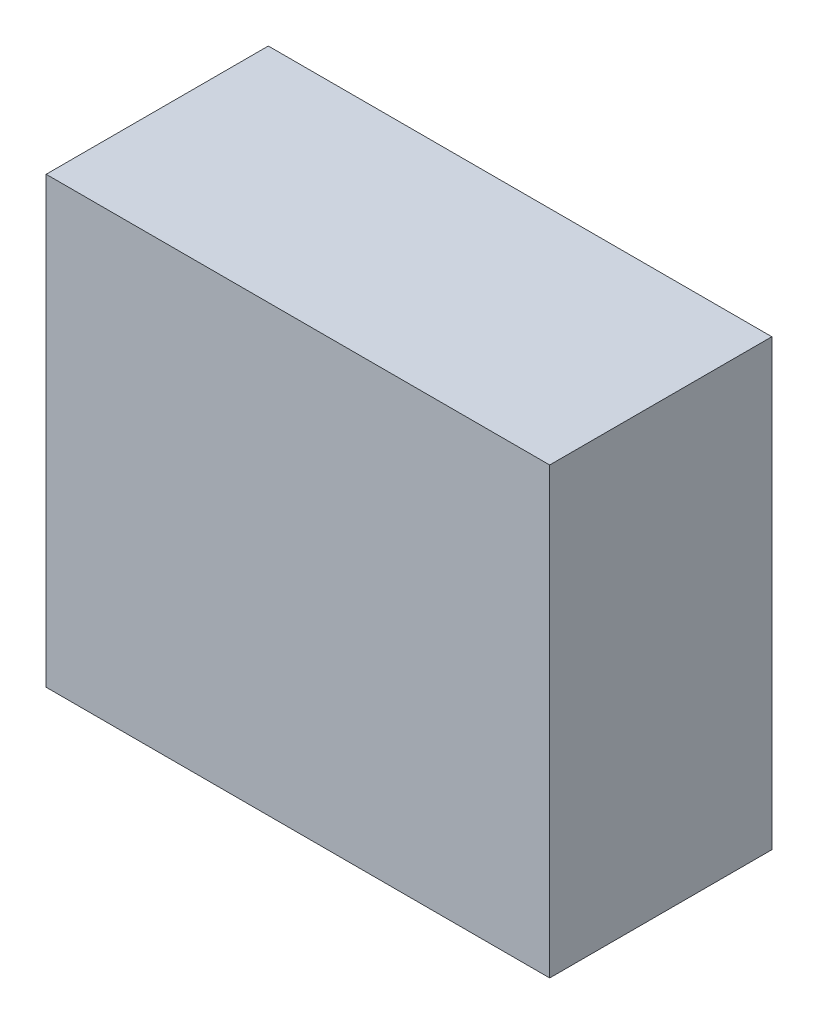
ISO-10303-21;
HEADER;
FILE_DESCRIPTION(('STEP AP214'),'2;1');
FILE_NAME('part.step','',(''),(''),'','','');
FILE_SCHEMA(('AUTOMOTIVE_DESIGN { 1 0 10303 214 1 1 1 1 }'));
ENDSEC;
DATA;
#1=APPLICATION_CONTEXT('core data for automotive mechanical design processes');
#2=APPLICATION_PROTOCOL_DEFINITION('international standard','automotive_design',2000,#1);
#3=PRODUCT_CONTEXT('',#1,'mechanical');
#4=PRODUCT('Part','Part','',(#3));
#5=PRODUCT_RELATED_PRODUCT_CATEGORY('part','',(#4));
#6=PRODUCT_DEFINITION_FORMATION('','',#4);
#7=PRODUCT_DEFINITION_CONTEXT('part definition',#1,'design');
#8=PRODUCT_DEFINITION('design','',#6,#7);
#9=PRODUCT_DEFINITION_SHAPE('','',#8);
#10=(LENGTH_UNIT() NAMED_UNIT(*) SI_UNIT(.MILLI.,.METRE.));
#11=(NAMED_UNIT(*) PLANE_ANGLE_UNIT() SI_UNIT($,.RADIAN.));
#12=(NAMED_UNIT(*) SI_UNIT($,.STERADIAN.) SOLID_ANGLE_UNIT());
#13=UNCERTAINTY_MEASURE_WITH_UNIT(LENGTH_MEASURE(1.E-05),#10,'distance_accuracy_value','');
#14=(GEOMETRIC_REPRESENTATION_CONTEXT(3) GLOBAL_UNCERTAINTY_ASSIGNED_CONTEXT((#13)) GLOBAL_UNIT_ASSIGNED_CONTEXT((#10,
#11,#12)) REPRESENTATION_CONTEXT('',''));
#15=CARTESIAN_POINT('',(0.,0.,0.));
#16=DIRECTION('',(0.,0.,1.));
#17=DIRECTION('',(1.,0.,0.));
#18=AXIS2_PLACEMENT_3D('',#15,#16,#17);
#19=CARTESIAN_POINT('',(-17.,-15.,15.));
#20=DIRECTION('',(1.,0.,0.));
#21=DIRECTION('',(0.,0.,-1.));
#22=AXIS2_PLACEMENT_3D('',#19,#20,#21);
#23=PLANE('',#22);
#24=DIRECTION('',(0.,-1.,0.));
#25=VECTOR('',#24,1.);
#26=CARTESIAN_POINT('',(-17.,-15.,0.));
#27=LINE('',#26,#25);
#28=CARTESIAN_POINT('',(-17.,15.,0.));
#29=VERTEX_POINT('',#28);
#30=CARTESIAN_POINT('',(-17.,-15.,0.));
#31=VERTEX_POINT('',#30);
#32=EDGE_CURVE('E110',#29,#31,#27,.T.);
#33=ORIENTED_EDGE('',*,*,#32,.T.);
#34=DIRECTION('',(0.,0.,-1.));
#35=VECTOR('',#34,1.);
#36=CARTESIAN_POINT('',(-17.,-15.,15.));
#37=LINE('',#36,#35);
#38=CARTESIAN_POINT('',(-17.,-15.,15.));
#39=VERTEX_POINT('',#38);
#40=EDGE_CURVE('E99',#39,#31,#37,.T.);
#41=ORIENTED_EDGE('',*,*,#40,.F.);
#42=DIRECTION('',(0.,-1.,0.));
#43=VECTOR('',#42,1.);
#44=CARTESIAN_POINT('',(-17.,-15.,15.));
#45=LINE('',#44,#43);
#46=CARTESIAN_POINT('',(-17.,15.,15.));
#47=VERTEX_POINT('',#46);
#48=EDGE_CURVE('E93',#47,#39,#45,.T.);
#49=ORIENTED_EDGE('',*,*,#48,.F.);
#50=DIRECTION('',(0.,0.,-1.));
#51=VECTOR('',#50,1.);
#52=CARTESIAN_POINT('',(-17.,15.,15.));
#53=LINE('',#52,#51);
#54=EDGE_CURVE('E106',#47,#29,#53,.T.);
#55=ORIENTED_EDGE('',*,*,#54,.T.);
#56=EDGE_LOOP('',(#33,#41,#49,#55));
#57=FACE_BOUND('',#56,.T.);
#58=ADVANCED_FACE('F38',(#57),#23,.F.);
#59=CARTESIAN_POINT('',(-17.,-15.,15.));
#60=DIRECTION('',(0.,1.,0.));
#61=DIRECTION('',(0.,0.,1.));
#62=AXIS2_PLACEMENT_3D('',#59,#60,#61);
#63=PLANE('',#62);
#64=DIRECTION('',(1.,0.,0.));
#65=VECTOR('',#64,1.);
#66=CARTESIAN_POINT('',(-17.,-15.,0.));
#67=LINE('',#66,#65);
#68=CARTESIAN_POINT('',(17.,-15.,0.));
#69=VERTEX_POINT('',#68);
#70=EDGE_CURVE('E98',#31,#69,#67,.T.);
#71=ORIENTED_EDGE('',*,*,#70,.T.);
#72=DIRECTION('',(0.,0.,-1.));
#73=VECTOR('',#72,1.);
#74=CARTESIAN_POINT('',(17.,-15.,15.));
#75=LINE('',#74,#73);
#76=CARTESIAN_POINT('',(17.,-15.,15.));
#77=VERTEX_POINT('',#76);
#78=EDGE_CURVE('E96',#77,#69,#75,.T.);
#79=ORIENTED_EDGE('',*,*,#78,.F.);
#80=DIRECTION('',(1.,0.,0.));
#81=VECTOR('',#80,1.);
#82=CARTESIAN_POINT('',(-17.,-15.,15.));
#83=LINE('',#82,#81);
#84=EDGE_CURVE('E88',#39,#77,#83,.T.);
#85=ORIENTED_EDGE('',*,*,#84,.F.);
#86=ORIENTED_EDGE('',*,*,#40,.T.);
#87=EDGE_LOOP('',(#71,#79,#85,#86));
#88=FACE_BOUND('',#87,.T.);
#89=ADVANCED_FACE('F97',(#88),#63,.F.);
#90=CARTESIAN_POINT('',(17.,-15.,15.));
#91=DIRECTION('',(-1.,0.,0.));
#92=DIRECTION('',(0.,0.,1.));
#93=AXIS2_PLACEMENT_3D('',#90,#91,#92);
#94=PLANE('',#93);
#95=DIRECTION('',(0.,1.,0.));
#96=VECTOR('',#95,1.);
#97=CARTESIAN_POINT('',(17.,-15.,0.));
#98=LINE('',#97,#96);
#99=CARTESIAN_POINT('',(17.,15.,0.));
#100=VERTEX_POINT('',#99);
#101=EDGE_CURVE('E74',#69,#100,#98,.T.);
#102=ORIENTED_EDGE('',*,*,#101,.T.);
#103=DIRECTION('',(0.,0.,-1.));
#104=VECTOR('',#103,1.);
#105=CARTESIAN_POINT('',(17.,15.,15.));
#106=LINE('',#105,#104);
#107=CARTESIAN_POINT('',(17.,15.,15.));
#108=VERTEX_POINT('',#107);
#109=EDGE_CURVE('E100',#108,#100,#106,.T.);
#110=ORIENTED_EDGE('',*,*,#109,.F.);
#111=DIRECTION('',(0.,1.,0.));
#112=VECTOR('',#111,1.);
#113=CARTESIAN_POINT('',(17.,-15.,15.));
#114=LINE('',#113,#112);
#115=EDGE_CURVE('E91',#77,#108,#114,.T.);
#116=ORIENTED_EDGE('',*,*,#115,.F.);
#117=ORIENTED_EDGE('',*,*,#78,.T.);
#118=EDGE_LOOP('',(#102,#110,#116,#117));
#119=FACE_BOUND('',#118,.T.);
#120=ADVANCED_FACE('F102',(#119),#94,.F.);
#121=CARTESIAN_POINT('',(-17.,15.,15.));
#122=DIRECTION('',(0.,-1.,0.));
#123=DIRECTION('',(0.,0.,-1.));
#124=AXIS2_PLACEMENT_3D('',#121,#122,#123);
#125=PLANE('',#124);
#126=DIRECTION('',(-1.,0.,0.));
#127=VECTOR('',#126,1.);
#128=CARTESIAN_POINT('',(-17.,15.,0.));
#129=LINE('',#128,#127);
#130=EDGE_CURVE('E80',#100,#29,#129,.T.);
#131=ORIENTED_EDGE('',*,*,#130,.T.);
#132=ORIENTED_EDGE('',*,*,#54,.F.);
#133=DIRECTION('',(-1.,0.,0.));
#134=VECTOR('',#133,1.);
#135=CARTESIAN_POINT('',(-17.,15.,15.));
#136=LINE('',#135,#134);
#137=EDGE_CURVE('E57',#108,#47,#136,.T.);
#138=ORIENTED_EDGE('',*,*,#137,.F.);
#139=ORIENTED_EDGE('',*,*,#109,.T.);
#140=EDGE_LOOP('',(#131,#132,#138,#139));
#141=FACE_BOUND('',#140,.T.);
#142=ADVANCED_FACE('F237',(#141),#125,.F.);
#143=CARTESIAN_POINT('',(0.,0.,15.));
#144=DIRECTION('',(0.,0.,-1.));
#145=DIRECTION('',(-1.,0.,0.));
#146=AXIS2_PLACEMENT_3D('',#143,#144,#145);
#147=PLANE('',#146);
#148=ORIENTED_EDGE('',*,*,#48,.T.);
#149=ORIENTED_EDGE('',*,*,#84,.T.);
#150=ORIENTED_EDGE('',*,*,#115,.T.);
#151=ORIENTED_EDGE('',*,*,#137,.T.);
#152=EDGE_LOOP('',(#148,#149,#150,#151));
#153=FACE_BOUND('',#152,.T.);
#154=ADVANCED_FACE('F89',(#153),#147,.F.);
#155=CARTESIAN_POINT('',(0.,0.,0.));
#156=DIRECTION('',(0.,0.,-1.));
#157=DIRECTION('',(-1.,0.,0.));
#158=AXIS2_PLACEMENT_3D('',#155,#156,#157);
#159=PLANE('',#158);
#160=CARTESIAN_POINT('',(11.9999999999999,-8.99999999999998,0.));
#161=DIRECTION('',(0.,0.,-1.));
#162=DIRECTION('',(-1.,0.,0.));
#163=AXIS2_PLACEMENT_3D('',#160,#161,#162);
#164=CIRCLE('',#163,3.10000000000002);
#165=CARTESIAN_POINT('',(8.89999999999993,-8.99999999999998,0.));
#166=VERTEX_POINT('',#165);
#167=EDGE_CURVE('E134',#166,#166,#164,.F.);
#168=ORIENTED_EDGE('',*,*,#167,.T.);
#169=EDGE_LOOP('',(#168));
#170=FACE_BOUND('',#169,.T.);
#171=CARTESIAN_POINT('',(-12.0000000000001,-8.99999999999999,0.));
#172=DIRECTION('',(0.,0.,-1.));
#173=DIRECTION('',(-1.,0.,0.));
#174=AXIS2_PLACEMENT_3D('',#171,#172,#173);
#175=CIRCLE('',#174,3.1);
#176=CARTESIAN_POINT('',(-15.1000000000001,-8.99999999999999,0.));
#177=VERTEX_POINT('',#176);
#178=EDGE_CURVE('E131',#177,#177,#175,.F.);
#179=ORIENTED_EDGE('',*,*,#178,.T.);
#180=EDGE_LOOP('',(#179));
#181=FACE_BOUND('',#180,.T.);
#182=CARTESIAN_POINT('',(-12.0000000000001,9.00000000000001,0.));
#183=DIRECTION('',(0.,0.,-1.));
#184=DIRECTION('',(-1.,0.,0.));
#185=AXIS2_PLACEMENT_3D('',#182,#183,#184);
#186=CIRCLE('',#185,3.1);
#187=CARTESIAN_POINT('',(-15.1000000000001,9.00000000000001,0.));
#188=VERTEX_POINT('',#187);
#189=EDGE_CURVE('E128',#188,#188,#186,.F.);
#190=ORIENTED_EDGE('',*,*,#189,.T.);
#191=EDGE_LOOP('',(#190));
#192=FACE_BOUND('',#191,.T.);
#193=CARTESIAN_POINT('',(11.9999999999999,8.99999999999999,0.));
#194=DIRECTION('',(0.,0.,-1.));
#195=DIRECTION('',(-1.,0.,0.));
#196=AXIS2_PLACEMENT_3D('',#193,#194,#195);
#197=CIRCLE('',#196,3.10000000000002);
#198=CARTESIAN_POINT('',(8.89999999999991,8.99999999999999,0.));
#199=VERTEX_POINT('',#198);
#200=EDGE_CURVE('E124',#199,#199,#197,.F.);
#201=ORIENTED_EDGE('',*,*,#200,.T.);
#202=EDGE_LOOP('',(#201));
#203=FACE_BOUND('',#202,.T.);
#204=ORIENTED_EDGE('',*,*,#32,.F.);
#205=ORIENTED_EDGE('',*,*,#130,.F.);
#206=ORIENTED_EDGE('',*,*,#101,.F.);
#207=ORIENTED_EDGE('',*,*,#70,.F.);
#208=EDGE_LOOP('',(#204,#205,#206,#207));
#209=FACE_BOUND('',#208,.T.);
#210=ADVANCED_FACE('F233',(#170,#181,#192,#203,#209),#159,.T.);
#211=CARTESIAN_POINT('',(-12.0000000000001,-8.99999999999999,6.));
#212=DIRECTION('',(0.,0.,-1.));
#213=DIRECTION('',(-1.,0.,0.));
#214=AXIS2_PLACEMENT_3D('',#211,#212,#213);
#215=CYLINDRICAL_SURFACE('',#214,2.1);
#216=CARTESIAN_POINT('',(-12.0000000000001,-8.99999999999999,1.));
#217=DIRECTION('',(0.,0.,-1.));
#218=DIRECTION('',(-1.,0.,0.));
#219=AXIS2_PLACEMENT_3D('',#216,#217,#218);
#220=CIRCLE('',#219,2.1);
#221=CARTESIAN_POINT('',(-14.1000000000001,-8.99999999999999,1.));
#222=VERTEX_POINT('',#221);
#223=EDGE_CURVE('E138',#222,#222,#220,.T.);
#224=ORIENTED_EDGE('',*,*,#223,.T.);
#225=EDGE_LOOP('',(#224));
#226=FACE_BOUND('',#225,.T.);
#227=CARTESIAN_POINT('',(-12.0000000000001,-8.99999999999999,6.));
#228=DIRECTION('',(0.,0.,-1.));
#229=DIRECTION('',(-1.,0.,0.));
#230=AXIS2_PLACEMENT_3D('',#227,#228,#229);
#231=CIRCLE('',#230,2.1);
#232=CARTESIAN_POINT('',(-14.1000000000001,-8.99999999999999,6.));
#233=VERTEX_POINT('',#232);
#234=EDGE_CURVE('E113',#233,#233,#231,.T.);
#235=ORIENTED_EDGE('',*,*,#234,.F.);
#236=EDGE_LOOP('',(#235));
#237=FACE_BOUND('',#236,.T.);
#238=ADVANCED_FACE('F222',(#226,#237),#215,.F.);
#239=CARTESIAN_POINT('',(-12.0000000000001,-8.99999999999999,6.));
#240=DIRECTION('',(0.,0.,-1.));
#241=DIRECTION('',(-1.,0.,0.));
#242=AXIS2_PLACEMENT_3D('',#239,#240,#241);
#243=PLANE('',#242);
#244=ORIENTED_EDGE('',*,*,#234,.T.);
#245=EDGE_LOOP('',(#244));
#246=FACE_BOUND('',#245,.T.);
#247=ADVANCED_FACE('F214',(#246),#243,.T.);
#248=CARTESIAN_POINT('',(-12.0000000000001,9.00000000000001,6.));
#249=DIRECTION('',(0.,0.,-1.));
#250=DIRECTION('',(-1.,0.,0.));
#251=AXIS2_PLACEMENT_3D('',#248,#249,#250);
#252=CYLINDRICAL_SURFACE('',#251,2.1);
#253=CARTESIAN_POINT('',(-12.0000000000001,9.00000000000001,1.));
#254=DIRECTION('',(0.,0.,-1.));
#255=DIRECTION('',(-1.,0.,0.));
#256=AXIS2_PLACEMENT_3D('',#253,#254,#255);
#257=CIRCLE('',#256,2.1);
#258=CARTESIAN_POINT('',(-14.1000000000001,9.00000000000001,1.));
#259=VERTEX_POINT('',#258);
#260=EDGE_CURVE('E49',#259,#259,#257,.T.);
#261=ORIENTED_EDGE('',*,*,#260,.T.);
#262=EDGE_LOOP('',(#261));
#263=FACE_BOUND('',#262,.T.);
#264=CARTESIAN_POINT('',(-12.0000000000001,9.00000000000001,6.));
#265=DIRECTION('',(0.,0.,-1.));
#266=DIRECTION('',(-1.,0.,0.));
#267=AXIS2_PLACEMENT_3D('',#264,#265,#266);
#268=CIRCLE('',#267,2.1);
#269=CARTESIAN_POINT('',(-14.1000000000001,9.00000000000001,6.));
#270=VERTEX_POINT('',#269);
#271=EDGE_CURVE('E202',#270,#270,#268,.T.);
#272=ORIENTED_EDGE('',*,*,#271,.F.);
#273=EDGE_LOOP('',(#272));
#274=FACE_BOUND('',#273,.T.);
#275=ADVANCED_FACE('F143',(#263,#274),#252,.F.);
#276=CARTESIAN_POINT('',(-12.0000000000001,9.00000000000001,6.));
#277=DIRECTION('',(0.,0.,-1.));
#278=DIRECTION('',(-1.,0.,0.));
#279=AXIS2_PLACEMENT_3D('',#276,#277,#278);
#280=PLANE('',#279);
#281=ORIENTED_EDGE('',*,*,#271,.T.);
#282=EDGE_LOOP('',(#281));
#283=FACE_BOUND('',#282,.T.);
#284=ADVANCED_FACE('F212',(#283),#280,.T.);
#285=CARTESIAN_POINT('',(11.9999999999999,8.99999999999999,6.));
#286=DIRECTION('',(0.,0.,-1.));
#287=DIRECTION('',(-1.,0.,0.));
#288=AXIS2_PLACEMENT_3D('',#285,#286,#287);
#289=CYLINDRICAL_SURFACE('',#288,2.1);
#290=CARTESIAN_POINT('',(11.9999999999999,8.99999999999999,1.00000000000002));
#291=DIRECTION('',(0.,0.,-1.));
#292=DIRECTION('',(-1.,0.,0.));
#293=AXIS2_PLACEMENT_3D('',#290,#291,#292);
#294=CIRCLE('',#293,2.1);
#295=CARTESIAN_POINT('',(9.89999999999993,8.99999999999999,1.00000000000002));
#296=VERTEX_POINT('',#295);
#297=EDGE_CURVE('E11',#296,#296,#294,.T.);
#298=ORIENTED_EDGE('',*,*,#297,.T.);
#299=EDGE_LOOP('',(#298));
#300=FACE_BOUND('',#299,.T.);
#301=CARTESIAN_POINT('',(11.9999999999999,8.99999999999999,6.));
#302=DIRECTION('',(0.,0.,-1.));
#303=DIRECTION('',(-1.,0.,0.));
#304=AXIS2_PLACEMENT_3D('',#301,#302,#303);
#305=CIRCLE('',#304,2.1);
#306=CARTESIAN_POINT('',(9.89999999999993,8.99999999999999,6.));
#307=VERTEX_POINT('',#306);
#308=EDGE_CURVE('E199',#307,#307,#305,.T.);
#309=ORIENTED_EDGE('',*,*,#308,.F.);
#310=EDGE_LOOP('',(#309));
#311=FACE_BOUND('',#310,.T.);
#312=ADVANCED_FACE('F220',(#300,#311),#289,.F.);
#313=CARTESIAN_POINT('',(11.9999999999999,8.99999999999999,6.));
#314=DIRECTION('',(0.,0.,-1.));
#315=DIRECTION('',(-1.,0.,0.));
#316=AXIS2_PLACEMENT_3D('',#313,#314,#315);
#317=PLANE('',#316);
#318=ORIENTED_EDGE('',*,*,#308,.T.);
#319=EDGE_LOOP('',(#318));
#320=FACE_BOUND('',#319,.T.);
#321=ADVANCED_FACE('F194',(#320),#317,.T.);
#322=CARTESIAN_POINT('',(11.9999999999999,-8.99999999999998,6.));
#323=DIRECTION('',(0.,0.,-1.));
#324=DIRECTION('',(-1.,0.,0.));
#325=AXIS2_PLACEMENT_3D('',#322,#323,#324);
#326=CYLINDRICAL_SURFACE('',#325,2.1);
#327=CARTESIAN_POINT('',(11.9999999999999,-8.99999999999998,1.00000000000002));
#328=DIRECTION('',(0.,0.,-1.));
#329=DIRECTION('',(-1.,0.,0.));
#330=AXIS2_PLACEMENT_3D('',#327,#328,#329);
#331=CIRCLE('',#330,2.1);
#332=CARTESIAN_POINT('',(9.89999999999995,-8.99999999999998,1.00000000000002));
#333=VERTEX_POINT('',#332);
#334=EDGE_CURVE('E121',#333,#333,#331,.T.);
#335=ORIENTED_EDGE('',*,*,#334,.T.);
#336=EDGE_LOOP('',(#335));
#337=FACE_BOUND('',#336,.T.);
#338=CARTESIAN_POINT('',(11.9999999999999,-8.99999999999998,6.));
#339=DIRECTION('',(0.,0.,-1.));
#340=DIRECTION('',(-1.,0.,0.));
#341=AXIS2_PLACEMENT_3D('',#338,#339,#340);
#342=CIRCLE('',#341,2.1);
#343=CARTESIAN_POINT('',(9.89999999999995,-8.99999999999998,6.));
#344=VERTEX_POINT('',#343);
#345=EDGE_CURVE('E198',#344,#344,#342,.T.);
#346=ORIENTED_EDGE('',*,*,#345,.F.);
#347=EDGE_LOOP('',(#346));
#348=FACE_BOUND('',#347,.T.);
#349=ADVANCED_FACE('F185',(#337,#348),#326,.F.);
#350=CARTESIAN_POINT('',(11.9999999999999,-8.99999999999998,6.));
#351=DIRECTION('',(0.,0.,-1.));
#352=DIRECTION('',(-1.,0.,0.));
#353=AXIS2_PLACEMENT_3D('',#350,#351,#352);
#354=PLANE('',#353);
#355=ORIENTED_EDGE('',*,*,#345,.T.);
#356=EDGE_LOOP('',(#355));
#357=FACE_BOUND('',#356,.T.);
#358=ADVANCED_FACE('F174',(#357),#354,.T.);
#359=CARTESIAN_POINT('',(11.9999999999999,-8.99999999999998,1.00000000000002));
#360=DIRECTION('',(0.,0.,-1.));
#361=DIRECTION('',(-1.,0.,0.));
#362=AXIS2_PLACEMENT_3D('',#359,#360,#361);
#363=CONICAL_SURFACE('',#362,2.1,0.785398163397448);
#364=ORIENTED_EDGE('',*,*,#167,.F.);
#365=EDGE_LOOP('',(#364));
#366=FACE_BOUND('',#365,.T.);
#367=ORIENTED_EDGE('',*,*,#334,.F.);
#368=EDGE_LOOP('',(#367));
#369=FACE_BOUND('',#368,.T.);
#370=ADVANCED_FACE('F155',(#366,#369),#363,.F.);
#371=CARTESIAN_POINT('',(-12.0000000000001,-8.99999999999999,1.));
#372=DIRECTION('',(0.,0.,-1.));
#373=DIRECTION('',(-1.,0.,0.));
#374=AXIS2_PLACEMENT_3D('',#371,#372,#373);
#375=CONICAL_SURFACE('',#374,2.1,0.785398163397448);
#376=ORIENTED_EDGE('',*,*,#178,.F.);
#377=EDGE_LOOP('',(#376));
#378=FACE_BOUND('',#377,.T.);
#379=ORIENTED_EDGE('',*,*,#223,.F.);
#380=EDGE_LOOP('',(#379));
#381=FACE_BOUND('',#380,.T.);
#382=ADVANCED_FACE('F148',(#378,#381),#375,.F.);
#383=CARTESIAN_POINT('',(-12.0000000000001,9.00000000000001,1.));
#384=DIRECTION('',(0.,0.,-1.));
#385=DIRECTION('',(-1.,0.,0.));
#386=AXIS2_PLACEMENT_3D('',#383,#384,#385);
#387=CONICAL_SURFACE('',#386,2.1,0.785398163397448);
#388=ORIENTED_EDGE('',*,*,#189,.F.);
#389=EDGE_LOOP('',(#388));
#390=FACE_BOUND('',#389,.T.);
#391=ORIENTED_EDGE('',*,*,#260,.F.);
#392=EDGE_LOOP('',(#391));
#393=FACE_BOUND('',#392,.T.);
#394=ADVANCED_FACE('F146',(#390,#393),#387,.F.);
#395=CARTESIAN_POINT('',(11.9999999999999,8.99999999999999,1.00000000000002));
#396=DIRECTION('',(0.,0.,-1.));
#397=DIRECTION('',(-1.,0.,0.));
#398=AXIS2_PLACEMENT_3D('',#395,#396,#397);
#399=CONICAL_SURFACE('',#398,2.1,0.785398163397448);
#400=ORIENTED_EDGE('',*,*,#200,.F.);
#401=EDGE_LOOP('',(#400));
#402=FACE_BOUND('',#401,.T.);
#403=ORIENTED_EDGE('',*,*,#297,.F.);
#404=EDGE_LOOP('',(#403));
#405=FACE_BOUND('',#404,.T.);
#406=ADVANCED_FACE('F41',(#402,#405),#399,.F.);
#407=CLOSED_SHELL('',(#58,#89,#120,#142,#154,#210,#238,#247,#275,#284,#312,#321,#349,#358,#370,
#382,#394,#406));
#408=MANIFOLD_SOLID_BREP('B2',#407);
#409=ADVANCED_BREP_SHAPE_REPRESENTATION('',(#18,#408),#14);
#410=SHAPE_DEFINITION_REPRESENTATION(#9,#409);
ENDSEC;
END-ISO-10303-21;
